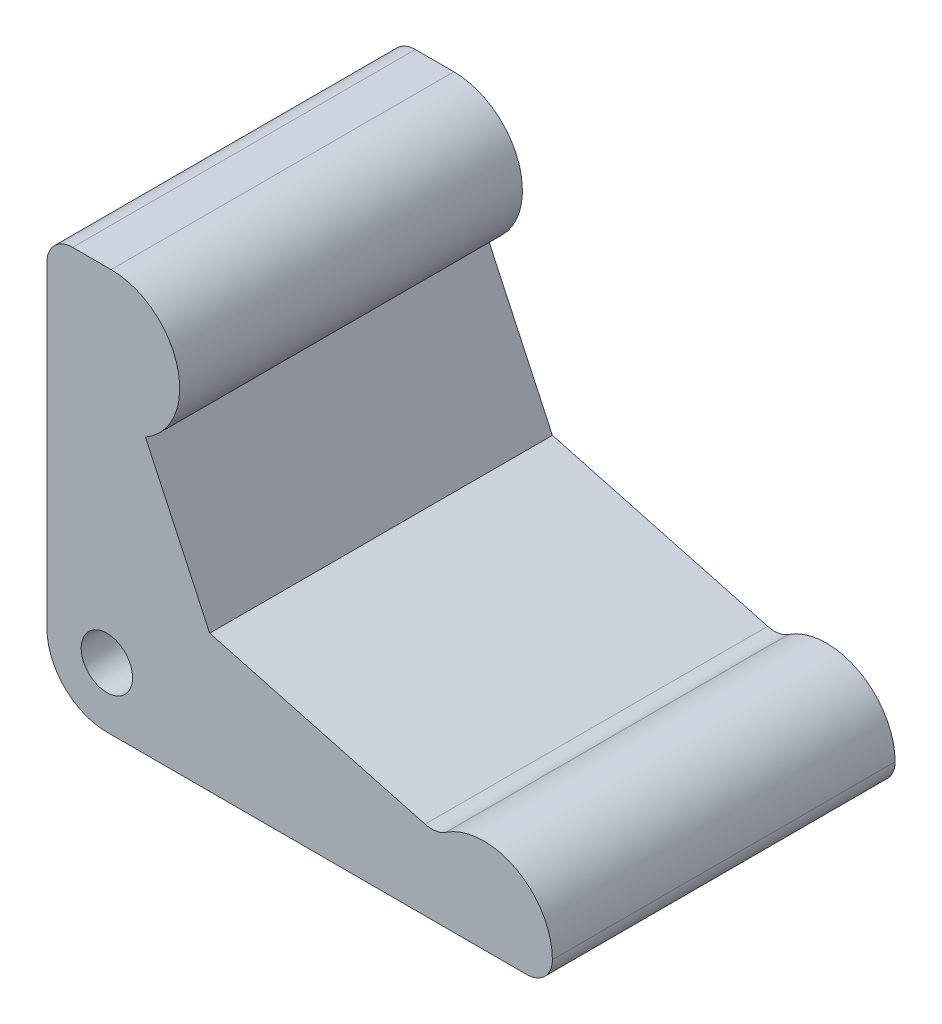
ISO-10303-21;
HEADER;
FILE_DESCRIPTION(('STEP AP214'),'2;1');
FILE_NAME('part.step','',(''),(''),'','','');
FILE_SCHEMA(('AUTOMOTIVE_DESIGN { 1 0 10303 214 1 1 1 1 }'));
ENDSEC;
DATA;
#1=APPLICATION_CONTEXT('core data for automotive mechanical design processes');
#2=APPLICATION_PROTOCOL_DEFINITION('international standard','automotive_design',2000,#1);
#3=PRODUCT_CONTEXT('',#1,'mechanical');
#4=PRODUCT('Part','Part','',(#3));
#5=PRODUCT_RELATED_PRODUCT_CATEGORY('part','',(#4));
#6=PRODUCT_DEFINITION_FORMATION('','',#4);
#7=PRODUCT_DEFINITION_CONTEXT('part definition',#1,'design');
#8=PRODUCT_DEFINITION('design','',#6,#7);
#9=PRODUCT_DEFINITION_SHAPE('','',#8);
#10=(LENGTH_UNIT() NAMED_UNIT(*) SI_UNIT(.MILLI.,.METRE.));
#11=(NAMED_UNIT(*) PLANE_ANGLE_UNIT() SI_UNIT($,.RADIAN.));
#12=(NAMED_UNIT(*) SI_UNIT($,.STERADIAN.) SOLID_ANGLE_UNIT());
#13=UNCERTAINTY_MEASURE_WITH_UNIT(LENGTH_MEASURE(1.E-05),#10,'distance_accuracy_value','');
#14=(GEOMETRIC_REPRESENTATION_CONTEXT(3) GLOBAL_UNCERTAINTY_ASSIGNED_CONTEXT((#13)) GLOBAL_UNIT_ASSIGNED_CONTEXT((#10,
#11,#12)) REPRESENTATION_CONTEXT('',''));
#15=CARTESIAN_POINT('',(0.,0.,0.));
#16=DIRECTION('',(0.,0.,1.));
#17=DIRECTION('',(1.,0.,0.));
#18=AXIS2_PLACEMENT_3D('',#15,#16,#17);
#19=CARTESIAN_POINT('',(7.5,39.,20.));
#20=DIRECTION('',(0.,0.,-1.));
#21=DIRECTION('',(-1.,0.,0.));
#22=AXIS2_PLACEMENT_3D('',#19,#20,#21);
#23=PLANE('',#22);
#24=CARTESIAN_POINT('',(7.5,39.,20.));
#25=DIRECTION('',(0.,0.,1.));
#26=DIRECTION('',(-1.,0.,0.));
#27=AXIS2_PLACEMENT_3D('',#24,#25,#26);
#28=CIRCLE('',#27,8.);
#29=CARTESIAN_POINT('',(11.5044099529175,32.0743447292711,20.));
#30=VERTEX_POINT('',#29);
#31=CARTESIAN_POINT('',(7.5,47.,20.));
#32=VERTEX_POINT('',#31);
#33=EDGE_CURVE('E198',#30,#32,#28,.T.);
#34=ORIENTED_EDGE('',*,*,#33,.T.);
#35=DIRECTION('',(-1.,0.,0.));
#36=VECTOR('',#35,1.);
#37=CARTESIAN_POINT('',(3.00000000000002,47.,20.));
#38=LINE('',#37,#36);
#39=CARTESIAN_POINT('',(3.00000000000002,47.,20.));
#40=VERTEX_POINT('',#39);
#41=EDGE_CURVE('E110',#32,#40,#38,.T.);
#42=ORIENTED_EDGE('',*,*,#41,.T.);
#43=CARTESIAN_POINT('',(3.,44.,20.));
#44=DIRECTION('',(0.,0.,1.));
#45=DIRECTION('',(1.,0.,0.));
#46=AXIS2_PLACEMENT_3D('',#43,#44,#45);
#47=CIRCLE('',#46,3.);
#48=CARTESIAN_POINT('',(0.,44.,20.));
#49=VERTEX_POINT('',#48);
#50=EDGE_CURVE('E232',#40,#49,#47,.T.);
#51=ORIENTED_EDGE('',*,*,#50,.T.);
#52=DIRECTION('',(0.,-1.,0.));
#53=VECTOR('',#52,1.);
#54=CARTESIAN_POINT('',(0.,7.00000000000005,20.));
#55=LINE('',#54,#53);
#56=CARTESIAN_POINT('',(0.,7.00000000000005,20.));
#57=VERTEX_POINT('',#56);
#58=EDGE_CURVE('E252',#49,#57,#55,.T.);
#59=ORIENTED_EDGE('',*,*,#58,.T.);
#60=CARTESIAN_POINT('',(7.,7.,20.));
#61=DIRECTION('',(0.,0.,1.));
#62=DIRECTION('',(-1.,0.,0.));
#63=AXIS2_PLACEMENT_3D('',#60,#61,#62);
#64=CIRCLE('',#63,7.);
#65=CARTESIAN_POINT('',(7.00000000000005,0.,20.));
#66=VERTEX_POINT('',#65);
#67=EDGE_CURVE('E248',#57,#66,#64,.T.);
#68=ORIENTED_EDGE('',*,*,#67,.T.);
#69=DIRECTION('',(1.,0.,0.));
#70=VECTOR('',#69,1.);
#71=CARTESIAN_POINT('',(7.00000000000005,0.,20.));
#72=LINE('',#71,#70);
#73=CARTESIAN_POINT('',(56.,0.,20.));
#74=VERTEX_POINT('',#73);
#75=EDGE_CURVE('E251',#66,#74,#72,.T.);
#76=ORIENTED_EDGE('',*,*,#75,.T.);
#77=CARTESIAN_POINT('',(56.,3.,20.));
#78=DIRECTION('',(0.,0.,1.));
#79=DIRECTION('',(1.,0.,0.));
#80=AXIS2_PLACEMENT_3D('',#77,#78,#79);
#81=CIRCLE('',#80,3.);
#82=CARTESIAN_POINT('',(59.,3.,20.));
#83=VERTEX_POINT('',#82);
#84=EDGE_CURVE('E256',#74,#83,#81,.T.);
#85=ORIENTED_EDGE('',*,*,#84,.T.);
#86=CARTESIAN_POINT('',(51.,3.,20.));
#87=DIRECTION('',(0.,0.,1.));
#88=DIRECTION('',(-1.,0.,0.));
#89=AXIS2_PLACEMENT_3D('',#86,#87,#88);
#90=CIRCLE('',#89,8.);
#91=CARTESIAN_POINT('',(46.5731872345712,9.66358227531084,20.));
#92=VERTEX_POINT('',#91);
#93=EDGE_CURVE('E139',#83,#92,#90,.T.);
#94=ORIENTED_EDGE('',*,*,#93,.T.);
#95=CARTESIAN_POINT('',(44.9131324475354,12.1624256285524,20.));
#96=DIRECTION('',(0.,0.,-1.));
#97=DIRECTION('',(-1.,0.,0.));
#98=AXIS2_PLACEMENT_3D('',#95,#96,#97);
#99=CIRCLE('',#98,3.);
#100=CARTESIAN_POINT('',(44.1366753122279,9.26464814968521,20.));
#101=VERTEX_POINT('',#100);
#102=EDGE_CURVE('E132',#92,#101,#99,.T.);
#103=ORIENTED_EDGE('',*,*,#102,.T.);
#104=DIRECTION('',(-0.965925826289068,0.258819045102521,0.));
#105=VECTOR('',#104,1.);
#106=CARTESIAN_POINT('',(19.,16.,20.));
#107=LINE('',#106,#105);
#108=CARTESIAN_POINT('',(19.,16.,20.));
#109=VERTEX_POINT('',#108);
#110=EDGE_CURVE('E136',#101,#109,#107,.T.);
#111=ORIENTED_EDGE('',*,*,#110,.T.);
#112=DIRECTION('',(-0.422618261740697,0.906307787036651,0.));
#113=VECTOR('',#112,1.);
#114=CARTESIAN_POINT('',(11.5044099529175,32.0743447292711,20.));
#115=LINE('',#114,#113);
#116=EDGE_CURVE('E61',#109,#30,#115,.T.);
#117=ORIENTED_EDGE('',*,*,#116,.T.);
#118=EDGE_LOOP('',(#34,#42,#51,#59,#68,#76,#85,#94,#103,#111,#117));
#119=FACE_BOUND('',#118,.T.);
#120=CARTESIAN_POINT('',(7.,7.,20.));
#121=DIRECTION('',(0.,0.,1.));
#122=DIRECTION('',(1.,0.,0.));
#123=AXIS2_PLACEMENT_3D('',#120,#121,#122);
#124=CIRCLE('',#123,3.);
#125=CARTESIAN_POINT('',(10.,7.,20.));
#126=VERTEX_POINT('',#125);
#127=EDGE_CURVE('E169',#126,#126,#124,.T.);
#128=ORIENTED_EDGE('',*,*,#127,.F.);
#129=EDGE_LOOP('',(#128));
#130=FACE_BOUND('',#129,.T.);
#131=ADVANCED_FACE('F39',(#119,#130),#23,.F.);
#132=CARTESIAN_POINT('',(7.5,39.,-20.));
#133=DIRECTION('',(0.,0.,-1.));
#134=DIRECTION('',(-1.,0.,0.));
#135=AXIS2_PLACEMENT_3D('',#132,#133,#134);
#136=PLANE('',#135);
#137=CARTESIAN_POINT('',(7.5,39.,-20.));
#138=DIRECTION('',(0.,0.,1.));
#139=DIRECTION('',(-1.,0.,0.));
#140=AXIS2_PLACEMENT_3D('',#137,#138,#139);
#141=CIRCLE('',#140,8.);
#142=CARTESIAN_POINT('',(11.5044099529175,32.0743447292711,-20.));
#143=VERTEX_POINT('',#142);
#144=CARTESIAN_POINT('',(7.5,47.,-20.));
#145=VERTEX_POINT('',#144);
#146=EDGE_CURVE('E164',#143,#145,#141,.T.);
#147=ORIENTED_EDGE('',*,*,#146,.F.);
#148=DIRECTION('',(-0.422618261740697,0.906307787036651,0.));
#149=VECTOR('',#148,1.);
#150=CARTESIAN_POINT('',(11.5044099529175,32.0743447292711,-20.));
#151=LINE('',#150,#149);
#152=CARTESIAN_POINT('',(19.,16.,-20.));
#153=VERTEX_POINT('',#152);
#154=EDGE_CURVE('E102',#153,#143,#151,.T.);
#155=ORIENTED_EDGE('',*,*,#154,.F.);
#156=DIRECTION('',(-0.965925826289068,0.258819045102521,0.));
#157=VECTOR('',#156,1.);
#158=CARTESIAN_POINT('',(19.,16.,-20.));
#159=LINE('',#158,#157);
#160=CARTESIAN_POINT('',(44.1366753122279,9.26464814968521,-20.));
#161=VERTEX_POINT('',#160);
#162=EDGE_CURVE('E193',#161,#153,#159,.T.);
#163=ORIENTED_EDGE('',*,*,#162,.F.);
#164=CARTESIAN_POINT('',(44.9131324475354,12.1624256285524,-20.));
#165=DIRECTION('',(0.,0.,-1.));
#166=DIRECTION('',(-1.,0.,0.));
#167=AXIS2_PLACEMENT_3D('',#164,#165,#166);
#168=CIRCLE('',#167,3.);
#169=CARTESIAN_POINT('',(46.5731872345712,9.66358227531084,-20.));
#170=VERTEX_POINT('',#169);
#171=EDGE_CURVE('E149',#170,#161,#168,.T.);
#172=ORIENTED_EDGE('',*,*,#171,.F.);
#173=CARTESIAN_POINT('',(51.,3.,-20.));
#174=DIRECTION('',(0.,0.,1.));
#175=DIRECTION('',(-1.,0.,0.));
#176=AXIS2_PLACEMENT_3D('',#173,#174,#175);
#177=CIRCLE('',#176,8.);
#178=CARTESIAN_POINT('',(59.,3.,-20.));
#179=VERTEX_POINT('',#178);
#180=EDGE_CURVE('E188',#179,#170,#177,.T.);
#181=ORIENTED_EDGE('',*,*,#180,.F.);
#182=CARTESIAN_POINT('',(56.,3.,-20.));
#183=DIRECTION('',(0.,0.,1.));
#184=DIRECTION('',(1.,0.,0.));
#185=AXIS2_PLACEMENT_3D('',#182,#183,#184);
#186=CIRCLE('',#185,3.);
#187=CARTESIAN_POINT('',(56.,0.,-20.));
#188=VERTEX_POINT('',#187);
#189=EDGE_CURVE('E185',#188,#179,#186,.T.);
#190=ORIENTED_EDGE('',*,*,#189,.F.);
#191=DIRECTION('',(1.,0.,0.));
#192=VECTOR('',#191,1.);
#193=CARTESIAN_POINT('',(7.00000000000005,0.,-20.));
#194=LINE('',#193,#192);
#195=CARTESIAN_POINT('',(7.00000000000005,0.,-20.));
#196=VERTEX_POINT('',#195);
#197=EDGE_CURVE('E181',#196,#188,#194,.T.);
#198=ORIENTED_EDGE('',*,*,#197,.F.);
#199=CARTESIAN_POINT('',(7.,7.,-20.));
#200=DIRECTION('',(0.,0.,1.));
#201=DIRECTION('',(-1.,0.,0.));
#202=AXIS2_PLACEMENT_3D('',#199,#200,#201);
#203=CIRCLE('',#202,7.);
#204=CARTESIAN_POINT('',(0.,7.00000000000005,-20.));
#205=VERTEX_POINT('',#204);
#206=EDGE_CURVE('E178',#205,#196,#203,.T.);
#207=ORIENTED_EDGE('',*,*,#206,.F.);
#208=DIRECTION('',(0.,-1.,0.));
#209=VECTOR('',#208,1.);
#210=CARTESIAN_POINT('',(0.,7.00000000000005,-20.));
#211=LINE('',#210,#209);
#212=CARTESIAN_POINT('',(0.,44.,-20.));
#213=VERTEX_POINT('',#212);
#214=EDGE_CURVE('E175',#213,#205,#211,.T.);
#215=ORIENTED_EDGE('',*,*,#214,.F.);
#216=CARTESIAN_POINT('',(3.,44.,-20.));
#217=DIRECTION('',(0.,0.,1.));
#218=DIRECTION('',(1.,0.,0.));
#219=AXIS2_PLACEMENT_3D('',#216,#217,#218);
#220=CIRCLE('',#219,3.);
#221=CARTESIAN_POINT('',(3.00000000000002,47.,-20.));
#222=VERTEX_POINT('',#221);
#223=EDGE_CURVE('E172',#222,#213,#220,.T.);
#224=ORIENTED_EDGE('',*,*,#223,.F.);
#225=DIRECTION('',(-1.,0.,0.));
#226=VECTOR('',#225,1.);
#227=CARTESIAN_POINT('',(3.00000000000002,47.,-20.));
#228=LINE('',#227,#226);
#229=EDGE_CURVE('E168',#145,#222,#228,.T.);
#230=ORIENTED_EDGE('',*,*,#229,.F.);
#231=EDGE_LOOP('',(#147,#155,#163,#172,#181,#190,#198,#207,#215,#224,#230));
#232=FACE_BOUND('',#231,.T.);
#233=CARTESIAN_POINT('',(7.,7.,-20.));
#234=DIRECTION('',(0.,0.,1.));
#235=DIRECTION('',(1.,0.,0.));
#236=AXIS2_PLACEMENT_3D('',#233,#234,#235);
#237=CIRCLE('',#236,3.);
#238=CARTESIAN_POINT('',(10.,7.,-20.));
#239=VERTEX_POINT('',#238);
#240=EDGE_CURVE('E281',#239,#239,#237,.T.);
#241=ORIENTED_EDGE('',*,*,#240,.T.);
#242=EDGE_LOOP('',(#241));
#243=FACE_BOUND('',#242,.T.);
#244=ADVANCED_FACE('F236',(#232,#243),#136,.T.);
#245=CARTESIAN_POINT('',(7.5,39.,20.));
#246=DIRECTION('',(0.,0.,-1.));
#247=DIRECTION('',(-1.,0.,0.));
#248=AXIS2_PLACEMENT_3D('',#245,#246,#247);
#249=CYLINDRICAL_SURFACE('',#248,8.);
#250=ORIENTED_EDGE('',*,*,#146,.T.);
#251=DIRECTION('',(0.,0.,-1.));
#252=VECTOR('',#251,1.);
#253=CARTESIAN_POINT('',(7.5,47.,20.));
#254=LINE('',#253,#252);
#255=EDGE_CURVE('E11',#32,#145,#254,.T.);
#256=ORIENTED_EDGE('',*,*,#255,.F.);
#257=ORIENTED_EDGE('',*,*,#33,.F.);
#258=DIRECTION('',(0.,0.,-1.));
#259=VECTOR('',#258,1.);
#260=CARTESIAN_POINT('',(11.5044099529175,32.0743447292711,20.));
#261=LINE('',#260,#259);
#262=EDGE_CURVE('E160',#30,#143,#261,.T.);
#263=ORIENTED_EDGE('',*,*,#262,.T.);
#264=EDGE_LOOP('',(#250,#256,#257,#263));
#265=FACE_BOUND('',#264,.T.);
#266=ADVANCED_FACE('F41',(#265),#249,.T.);
#267=CARTESIAN_POINT('',(3.00000000000002,47.,20.));
#268=DIRECTION('',(0.,-1.,0.));
#269=DIRECTION('',(1.,0.,0.));
#270=AXIS2_PLACEMENT_3D('',#267,#268,#269);
#271=PLANE('',#270);
#272=ORIENTED_EDGE('',*,*,#229,.T.);
#273=DIRECTION('',(0.,0.,-1.));
#274=VECTOR('',#273,1.);
#275=CARTESIAN_POINT('',(3.00000000000002,47.,20.));
#276=LINE('',#275,#274);
#277=EDGE_CURVE('E48',#40,#222,#276,.T.);
#278=ORIENTED_EDGE('',*,*,#277,.F.);
#279=ORIENTED_EDGE('',*,*,#41,.F.);
#280=ORIENTED_EDGE('',*,*,#255,.T.);
#281=EDGE_LOOP('',(#272,#278,#279,#280));
#282=FACE_BOUND('',#281,.T.);
#283=ADVANCED_FACE('F335',(#282),#271,.F.);
#284=CARTESIAN_POINT('',(3.,44.,20.));
#285=DIRECTION('',(0.,0.,-1.));
#286=DIRECTION('',(-1.,0.,0.));
#287=AXIS2_PLACEMENT_3D('',#284,#285,#286);
#288=CYLINDRICAL_SURFACE('',#287,3.);
#289=ORIENTED_EDGE('',*,*,#223,.T.);
#290=DIRECTION('',(0.,0.,-1.));
#291=VECTOR('',#290,1.);
#292=CARTESIAN_POINT('',(0.,44.,20.));
#293=LINE('',#292,#291);
#294=EDGE_CURVE('E222',#49,#213,#293,.T.);
#295=ORIENTED_EDGE('',*,*,#294,.F.);
#296=ORIENTED_EDGE('',*,*,#50,.F.);
#297=ORIENTED_EDGE('',*,*,#277,.T.);
#298=EDGE_LOOP('',(#289,#295,#296,#297));
#299=FACE_BOUND('',#298,.T.);
#300=ADVANCED_FACE('F230',(#299),#288,.T.);
#301=CARTESIAN_POINT('',(0.,7.00000000000005,20.));
#302=DIRECTION('',(1.,0.,0.));
#303=DIRECTION('',(0.,0.,-1.));
#304=AXIS2_PLACEMENT_3D('',#301,#302,#303);
#305=PLANE('',#304);
#306=ORIENTED_EDGE('',*,*,#214,.T.);
#307=DIRECTION('',(0.,0.,-1.));
#308=VECTOR('',#307,1.);
#309=CARTESIAN_POINT('',(0.,7.00000000000005,20.));
#310=LINE('',#309,#308);
#311=EDGE_CURVE('E218',#57,#205,#310,.T.);
#312=ORIENTED_EDGE('',*,*,#311,.F.);
#313=ORIENTED_EDGE('',*,*,#58,.F.);
#314=ORIENTED_EDGE('',*,*,#294,.T.);
#315=EDGE_LOOP('',(#306,#312,#313,#314));
#316=FACE_BOUND('',#315,.T.);
#317=ADVANCED_FACE('F242',(#316),#305,.F.);
#318=CARTESIAN_POINT('',(7.,7.,20.));
#319=DIRECTION('',(0.,0.,-1.));
#320=DIRECTION('',(-1.,0.,0.));
#321=AXIS2_PLACEMENT_3D('',#318,#319,#320);
#322=CYLINDRICAL_SURFACE('',#321,7.);
#323=ORIENTED_EDGE('',*,*,#206,.T.);
#324=DIRECTION('',(0.,0.,-1.));
#325=VECTOR('',#324,1.);
#326=CARTESIAN_POINT('',(7.00000000000005,0.,20.));
#327=LINE('',#326,#325);
#328=EDGE_CURVE('E214',#66,#196,#327,.T.);
#329=ORIENTED_EDGE('',*,*,#328,.F.);
#330=ORIENTED_EDGE('',*,*,#67,.F.);
#331=ORIENTED_EDGE('',*,*,#311,.T.);
#332=EDGE_LOOP('',(#323,#329,#330,#331));
#333=FACE_BOUND('',#332,.T.);
#334=ADVANCED_FACE('F246',(#333),#322,.T.);
#335=CARTESIAN_POINT('',(7.00000000000005,0.,20.));
#336=DIRECTION('',(0.,1.,0.));
#337=DIRECTION('',(0.,0.,1.));
#338=AXIS2_PLACEMENT_3D('',#335,#336,#337);
#339=PLANE('',#338);
#340=DIRECTION('',(0.,0.,-1.));
#341=VECTOR('',#340,1.);
#342=CARTESIAN_POINT('',(56.,0.,20.));
#343=LINE('',#342,#341);
#344=CARTESIAN_POINT('',(56.,0.,0.));
#345=VERTEX_POINT('',#344);
#346=EDGE_CURVE('E209',#345,#188,#343,.T.);
#347=ORIENTED_EDGE('',*,*,#346,.F.);
#348=CARTESIAN_POINT('',(49.,0.,0.));
#349=DIRECTION('',(0.,-1.,0.));
#350=DIRECTION('',(0.,0.,-1.));
#351=AXIS2_PLACEMENT_3D('',#348,#349,#350);
#352=CIRCLE('',#351,7.);
#353=EDGE_CURVE('E53',#345,#345,#352,.T.);
#354=ORIENTED_EDGE('',*,*,#353,.F.);
#355=EDGE_CURVE('E210',#74,#345,#343,.T.);
#356=ORIENTED_EDGE('',*,*,#355,.F.);
#357=ORIENTED_EDGE('',*,*,#75,.F.);
#358=ORIENTED_EDGE('',*,*,#328,.T.);
#359=ORIENTED_EDGE('',*,*,#197,.T.);
#360=EDGE_LOOP('',(#347,#354,#356,#357,#358,#359));
#361=FACE_BOUND('',#360,.T.);
#362=ADVANCED_FACE('F326',(#361),#339,.F.);
#363=CARTESIAN_POINT('',(56.,3.,20.));
#364=DIRECTION('',(0.,0.,-1.));
#365=DIRECTION('',(-1.,0.,0.));
#366=AXIS2_PLACEMENT_3D('',#363,#364,#365);
#367=CYLINDRICAL_SURFACE('',#366,3.);
#368=ORIENTED_EDGE('',*,*,#189,.T.);
#369=DIRECTION('',(0.,0.,-1.));
#370=VECTOR('',#369,1.);
#371=CARTESIAN_POINT('',(59.,3.,20.));
#372=LINE('',#371,#370);
#373=EDGE_CURVE('E205',#83,#179,#372,.T.);
#374=ORIENTED_EDGE('',*,*,#373,.F.);
#375=ORIENTED_EDGE('',*,*,#84,.F.);
#376=ORIENTED_EDGE('',*,*,#355,.T.);
#377=ORIENTED_EDGE('',*,*,#346,.T.);
#378=EDGE_LOOP('',(#368,#374,#375,#376,#377));
#379=FACE_BOUND('',#378,.T.);
#380=ADVANCED_FACE('F267',(#379),#367,.T.);
#381=CARTESIAN_POINT('',(51.,3.,20.));
#382=DIRECTION('',(0.,0.,-1.));
#383=DIRECTION('',(-1.,0.,0.));
#384=AXIS2_PLACEMENT_3D('',#381,#382,#383);
#385=CYLINDRICAL_SURFACE('',#384,8.);
#386=ORIENTED_EDGE('',*,*,#180,.T.);
#387=DIRECTION('',(0.,0.,-1.));
#388=VECTOR('',#387,1.);
#389=CARTESIAN_POINT('',(46.5731872345712,9.66358227531084,20.));
#390=LINE('',#389,#388);
#391=EDGE_CURVE('E153',#92,#170,#390,.T.);
#392=ORIENTED_EDGE('',*,*,#391,.F.);
#393=ORIENTED_EDGE('',*,*,#93,.F.);
#394=ORIENTED_EDGE('',*,*,#373,.T.);
#395=EDGE_LOOP('',(#386,#392,#393,#394));
#396=FACE_BOUND('',#395,.T.);
#397=ADVANCED_FACE('F271',(#396),#385,.T.);
#398=CARTESIAN_POINT('',(44.9131324475354,12.1624256285524,20.));
#399=DIRECTION('',(0.,0.,-1.));
#400=DIRECTION('',(-1.,0.,0.));
#401=AXIS2_PLACEMENT_3D('',#398,#399,#400);
#402=CYLINDRICAL_SURFACE('',#401,3.);
#403=ORIENTED_EDGE('',*,*,#171,.T.);
#404=DIRECTION('',(0.,0.,-1.));
#405=VECTOR('',#404,1.);
#406=CARTESIAN_POINT('',(44.1366753122279,9.26464814968521,20.));
#407=LINE('',#406,#405);
#408=EDGE_CURVE('E146',#101,#161,#407,.T.);
#409=ORIENTED_EDGE('',*,*,#408,.F.);
#410=ORIENTED_EDGE('',*,*,#102,.F.);
#411=ORIENTED_EDGE('',*,*,#391,.T.);
#412=EDGE_LOOP('',(#403,#409,#410,#411));
#413=FACE_BOUND('',#412,.T.);
#414=ADVANCED_FACE('F147',(#413),#402,.F.);
#415=CARTESIAN_POINT('',(19.,16.,20.));
#416=DIRECTION('',(-0.258819045102521,-0.965925826289068,0.));
#417=DIRECTION('',(0.965925826289068,-0.258819045102521,0.));
#418=AXIS2_PLACEMENT_3D('',#415,#416,#417);
#419=PLANE('',#418);
#420=ORIENTED_EDGE('',*,*,#162,.T.);
#421=DIRECTION('',(0.,0.,-1.));
#422=VECTOR('',#421,1.);
#423=CARTESIAN_POINT('',(19.,16.,20.));
#424=LINE('',#423,#422);
#425=EDGE_CURVE('E154',#109,#153,#424,.T.);
#426=ORIENTED_EDGE('',*,*,#425,.F.);
#427=ORIENTED_EDGE('',*,*,#110,.F.);
#428=ORIENTED_EDGE('',*,*,#408,.T.);
#429=EDGE_LOOP('',(#420,#426,#427,#428));
#430=FACE_BOUND('',#429,.T.);
#431=ADVANCED_FACE('F156',(#430),#419,.F.);
#432=CARTESIAN_POINT('',(11.5044099529175,32.0743447292711,20.));
#433=DIRECTION('',(-0.906307787036651,-0.422618261740697,0.));
#434=DIRECTION('',(0.422618261740697,-0.906307787036651,0.));
#435=AXIS2_PLACEMENT_3D('',#432,#433,#434);
#436=PLANE('',#435);
#437=ORIENTED_EDGE('',*,*,#154,.T.);
#438=ORIENTED_EDGE('',*,*,#262,.F.);
#439=ORIENTED_EDGE('',*,*,#116,.F.);
#440=ORIENTED_EDGE('',*,*,#425,.T.);
#441=EDGE_LOOP('',(#437,#438,#439,#440));
#442=FACE_BOUND('',#441,.T.);
#443=ADVANCED_FACE('F272',(#442),#436,.F.);
#444=CARTESIAN_POINT('',(7.,7.,20.));
#445=DIRECTION('',(0.,0.,-1.));
#446=DIRECTION('',(-1.,0.,0.));
#447=AXIS2_PLACEMENT_3D('',#444,#445,#446);
#448=CYLINDRICAL_SURFACE('',#447,3.);
#449=ORIENTED_EDGE('',*,*,#127,.T.);
#450=EDGE_LOOP('',(#449));
#451=FACE_BOUND('',#450,.T.);
#452=ORIENTED_EDGE('',*,*,#240,.F.);
#453=EDGE_LOOP('',(#452));
#454=FACE_BOUND('',#453,.T.);
#455=ADVANCED_FACE('F300',(#451,#454),#448,.F.);
#456=CARTESIAN_POINT('',(49.,4.,0.));
#457=DIRECTION('',(0.,-1.,0.));
#458=DIRECTION('',(0.,0.,-1.));
#459=AXIS2_PLACEMENT_3D('',#456,#457,#458);
#460=CYLINDRICAL_SURFACE('',#459,7.);
#461=CARTESIAN_POINT('',(49.,4.,0.));
#462=DIRECTION('',(0.,-1.,0.));
#463=DIRECTION('',(0.,0.,-1.));
#464=AXIS2_PLACEMENT_3D('',#461,#462,#463);
#465=CIRCLE('',#464,7.);
#466=CARTESIAN_POINT('',(49.,4.,-7.));
#467=VERTEX_POINT('',#466);
#468=EDGE_CURVE('E286',#467,#467,#465,.T.);
#469=ORIENTED_EDGE('',*,*,#468,.F.);
#470=EDGE_LOOP('',(#469));
#471=FACE_BOUND('',#470,.T.);
#472=ORIENTED_EDGE('',*,*,#353,.T.);
#473=EDGE_LOOP('',(#472));
#474=FACE_BOUND('',#473,.T.);
#475=ADVANCED_FACE('F298',(#471,#474),#460,.F.);
#476=CARTESIAN_POINT('',(49.,4.,0.));
#477=DIRECTION('',(0.,-1.,0.));
#478=DIRECTION('',(0.,0.,-1.));
#479=AXIS2_PLACEMENT_3D('',#476,#477,#478);
#480=PLANE('',#479);
#481=ORIENTED_EDGE('',*,*,#468,.T.);
#482=EDGE_LOOP('',(#481));
#483=FACE_BOUND('',#482,.T.);
#484=ADVANCED_FACE('F296',(#483),#480,.T.);
#485=CLOSED_SHELL('',(#131,#244,#266,#283,#300,#317,#334,#362,#380,#397,#414,#431,#443,#455,
#475,#484));
#486=MANIFOLD_SOLID_BREP('B2',#485);
#487=ADVANCED_BREP_SHAPE_REPRESENTATION('',(#18,#486),#14);
#488=SHAPE_DEFINITION_REPRESENTATION(#9,#487);
ENDSEC;
END-ISO-10303-21;
